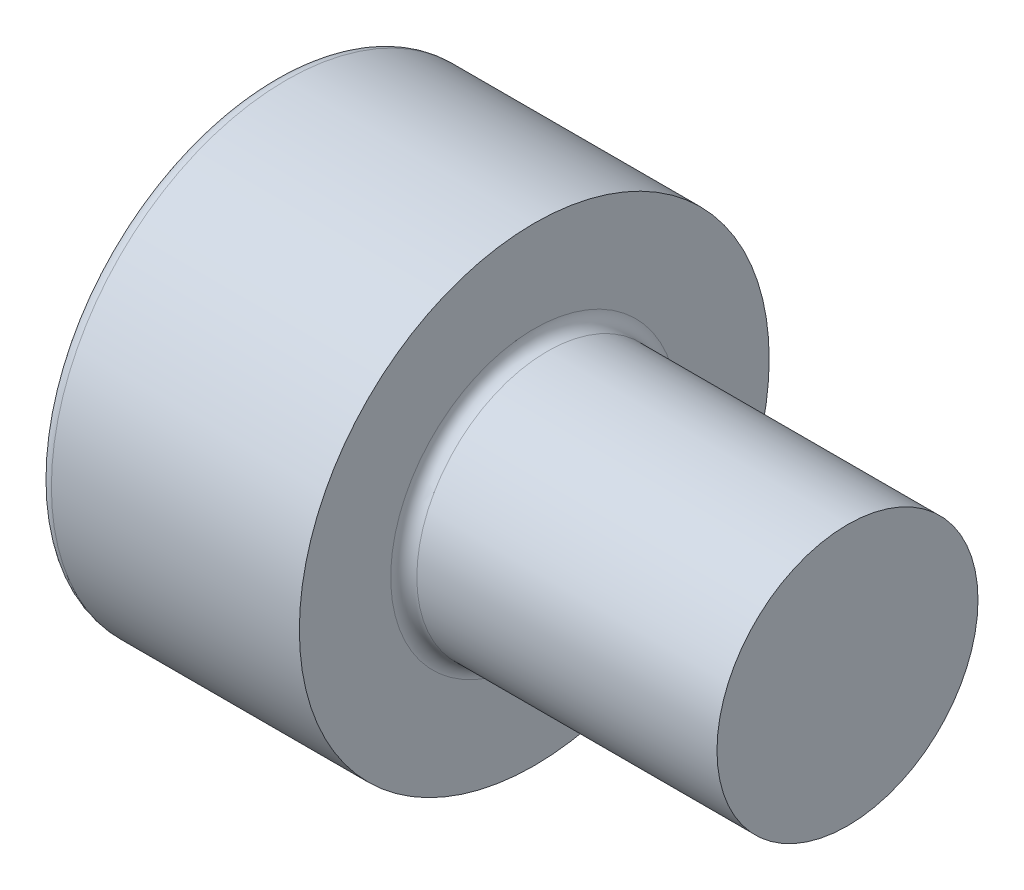
ISO-10303-21;
HEADER;
FILE_DESCRIPTION(('STEP AP214'),'2;1');
FILE_NAME('part.step','',(''),(''),'','','');
FILE_SCHEMA(('AUTOMOTIVE_DESIGN { 1 0 10303 214 1 1 1 1 }'));
ENDSEC;
DATA;
#1=APPLICATION_CONTEXT('core data for automotive mechanical design processes');
#2=APPLICATION_PROTOCOL_DEFINITION('international standard','automotive_design',2000,#1);
#3=PRODUCT_CONTEXT('',#1,'mechanical');
#4=PRODUCT('Part','Part','',(#3));
#5=PRODUCT_RELATED_PRODUCT_CATEGORY('part','',(#4));
#6=PRODUCT_DEFINITION_FORMATION('','',#4);
#7=PRODUCT_DEFINITION_CONTEXT('part definition',#1,'design');
#8=PRODUCT_DEFINITION('design','',#6,#7);
#9=PRODUCT_DEFINITION_SHAPE('','',#8);
#10=(LENGTH_UNIT() NAMED_UNIT(*) SI_UNIT(.MILLI.,.METRE.));
#11=(NAMED_UNIT(*) PLANE_ANGLE_UNIT() SI_UNIT($,.RADIAN.));
#12=(NAMED_UNIT(*) SI_UNIT($,.STERADIAN.) SOLID_ANGLE_UNIT());
#13=UNCERTAINTY_MEASURE_WITH_UNIT(LENGTH_MEASURE(1.E-05),#10,'distance_accuracy_value','');
#14=(GEOMETRIC_REPRESENTATION_CONTEXT(3) GLOBAL_UNCERTAINTY_ASSIGNED_CONTEXT((#13)) GLOBAL_UNIT_ASSIGNED_CONTEXT((#10,
#11,#12)) REPRESENTATION_CONTEXT('',''));
#15=CARTESIAN_POINT('',(0.,0.,0.));
#16=DIRECTION('',(0.,0.,1.));
#17=DIRECTION('',(1.,0.,0.));
#18=AXIS2_PLACEMENT_3D('',#15,#16,#17);
#19=CARTESIAN_POINT('',(10.5,0.,0.));
#20=DIRECTION('',(-1.,0.,0.));
#21=DIRECTION('',(0.,0.,1.));
#22=AXIS2_PLACEMENT_3D('',#19,#20,#21);
#23=CYLINDRICAL_SURFACE('',#22,1.25);
#24=CARTESIAN_POINT('',(2.625,0.,0.));
#25=DIRECTION('',(1.,0.,0.));
#26=DIRECTION('',(0.,0.,-1.));
#27=AXIS2_PLACEMENT_3D('',#24,#25,#26);
#28=CIRCLE('',#27,1.25);
#29=CARTESIAN_POINT('',(2.625,0.,-1.25));
#30=VERTEX_POINT('',#29);
#31=EDGE_CURVE('E171',#30,#30,#28,.T.);
#32=ORIENTED_EDGE('',*,*,#31,.T.);
#33=EDGE_LOOP('',(#32));
#34=FACE_BOUND('',#33,.T.);
#35=CARTESIAN_POINT('',(5.5,0.,0.));
#36=DIRECTION('',(1.,0.,0.));
#37=DIRECTION('',(0.,0.,-1.));
#38=AXIS2_PLACEMENT_3D('',#35,#36,#37);
#39=CIRCLE('',#38,1.25);
#40=CARTESIAN_POINT('',(5.5,0.,-1.25));
#41=VERTEX_POINT('',#40);
#42=EDGE_CURVE('E38',#41,#41,#39,.T.);
#43=ORIENTED_EDGE('',*,*,#42,.F.);
#44=EDGE_LOOP('',(#43));
#45=FACE_BOUND('',#44,.T.);
#46=ADVANCED_FACE('F34',(#34,#45),#23,.T.);
#47=CARTESIAN_POINT('',(1.1,0.,0.));
#48=DIRECTION('',(-1.,0.,0.));
#49=DIRECTION('',(0.,0.,1.));
#50=AXIS2_PLACEMENT_3D('',#47,#48,#49);
#51=PLANE('',#50);
#52=DIRECTION('',(0.,-1.,0.));
#53=VECTOR('',#52,1.);
#54=CARTESIAN_POINT('',(1.1,0.590340650246388,-1.0225));
#55=LINE('',#54,#53);
#56=CARTESIAN_POINT('',(1.1,0.590340650246388,-1.0225));
#57=VERTEX_POINT('',#56);
#58=CARTESIAN_POINT('',(1.10000000000581,0.,-1.0225));
#59=VERTEX_POINT('',#58);
#60=EDGE_CURVE('E224',#57,#59,#55,.T.);
#61=ORIENTED_EDGE('',*,*,#60,.T.);
#62=CARTESIAN_POINT('',(1.10000000000581,0.,0.));
#63=DIRECTION('',(1.,0.,0.));
#64=DIRECTION('',(0.,0.,-1.));
#65=AXIS2_PLACEMENT_3D('',#62,#63,#64);
#66=CIRCLE('',#65,1.02250000003191);
#67=CARTESIAN_POINT('',(1.10000000000581,0.885510975397226,-0.511250000015958));
#68=VERTEX_POINT('',#67);
#69=EDGE_CURVE('E50',#59,#68,#66,.T.);
#70=ORIENTED_EDGE('',*,*,#69,.T.);
#71=DIRECTION('',(0.,-0.500000000000001,-0.866025403784438));
#72=VECTOR('',#71,1.);
#73=CARTESIAN_POINT('',(1.1,1.18068130049278,0.));
#74=LINE('',#73,#72);
#75=EDGE_CURVE('E237',#68,#57,#74,.T.);
#76=ORIENTED_EDGE('',*,*,#75,.T.);
#77=EDGE_LOOP('',(#61,#70,#76));
#78=FACE_BOUND('',#77,.T.);
#79=ADVANCED_FACE('F121',(#78),#51,.T.);
#80=CARTESIAN_POINT('',(1.1,1.18068130049278,0.));
#81=VERTEX_POINT('',#80);
#82=EDGE_CURVE('E238',#81,#68,#74,.T.);
#83=ORIENTED_EDGE('',*,*,#82,.T.);
#84=CARTESIAN_POINT('',(1.10000000000581,0.885510975397227,0.511250000015956));
#85=VERTEX_POINT('',#84);
#86=EDGE_CURVE('E174',#68,#85,#66,.T.);
#87=ORIENTED_EDGE('',*,*,#86,.T.);
#88=DIRECTION('',(0.,0.499999999999999,-0.866025403784439));
#89=VECTOR('',#88,1.);
#90=CARTESIAN_POINT('',(1.1,0.59034065024639,1.0225));
#91=LINE('',#90,#89);
#92=EDGE_CURVE('E234',#85,#81,#91,.T.);
#93=ORIENTED_EDGE('',*,*,#92,.T.);
#94=EDGE_LOOP('',(#83,#87,#93));
#95=FACE_BOUND('',#94,.T.);
#96=ADVANCED_FACE('F130',(#95),#51,.T.);
#97=CARTESIAN_POINT('',(1.1,0.59034065024639,1.0225));
#98=VERTEX_POINT('',#97);
#99=EDGE_CURVE('E235',#98,#85,#91,.T.);
#100=ORIENTED_EDGE('',*,*,#99,.T.);
#101=CARTESIAN_POINT('',(1.10000000000581,0.,1.02250000003191));
#102=VERTEX_POINT('',#101);
#103=EDGE_CURVE('E198',#85,#102,#66,.T.);
#104=ORIENTED_EDGE('',*,*,#103,.T.);
#105=DIRECTION('',(0.,1.,0.));
#106=VECTOR('',#105,1.);
#107=CARTESIAN_POINT('',(1.1,-0.590340650246394,1.0225));
#108=LINE('',#107,#106);
#109=EDGE_CURVE('E231',#102,#98,#108,.T.);
#110=ORIENTED_EDGE('',*,*,#109,.T.);
#111=EDGE_LOOP('',(#100,#104,#110));
#112=FACE_BOUND('',#111,.T.);
#113=ADVANCED_FACE('F270',(#112),#51,.T.);
#114=CARTESIAN_POINT('',(1.1,-0.590340650246394,1.0225));
#115=VERTEX_POINT('',#114);
#116=EDGE_CURVE('E232',#115,#102,#108,.T.);
#117=ORIENTED_EDGE('',*,*,#116,.T.);
#118=CARTESIAN_POINT('',(1.10000000000581,-0.885510975397226,0.511250000015958));
#119=VERTEX_POINT('',#118);
#120=EDGE_CURVE('E203',#102,#119,#66,.T.);
#121=ORIENTED_EDGE('',*,*,#120,.T.);
#122=DIRECTION('',(0.,0.500000000000001,0.866025403784438));
#123=VECTOR('',#122,1.);
#124=CARTESIAN_POINT('',(1.1,-1.18068130049279,0.));
#125=LINE('',#124,#123);
#126=EDGE_CURVE('E228',#119,#115,#125,.T.);
#127=ORIENTED_EDGE('',*,*,#126,.T.);
#128=EDGE_LOOP('',(#117,#121,#127));
#129=FACE_BOUND('',#128,.T.);
#130=ADVANCED_FACE('F152',(#129),#51,.T.);
#131=CARTESIAN_POINT('',(1.1,-1.18068130049279,0.));
#132=VERTEX_POINT('',#131);
#133=EDGE_CURVE('E217',#132,#119,#125,.T.);
#134=ORIENTED_EDGE('',*,*,#133,.T.);
#135=CARTESIAN_POINT('',(1.10000000000581,-0.885510975397228,-0.511250000015955));
#136=VERTEX_POINT('',#135);
#137=EDGE_CURVE('E163',#119,#136,#66,.T.);
#138=ORIENTED_EDGE('',*,*,#137,.T.);
#139=DIRECTION('',(0.,-0.499999999999999,0.86602540378444));
#140=VECTOR('',#139,1.);
#141=CARTESIAN_POINT('',(1.1,-0.590340650246397,-1.0225));
#142=LINE('',#141,#140);
#143=EDGE_CURVE('E214',#136,#132,#142,.T.);
#144=ORIENTED_EDGE('',*,*,#143,.T.);
#145=EDGE_LOOP('',(#134,#138,#144));
#146=FACE_BOUND('',#145,.T.);
#147=ADVANCED_FACE('F122',(#146),#51,.T.);
#148=CARTESIAN_POINT('',(2.5,0.,0.));
#149=DIRECTION('',(-1.,0.,0.));
#150=DIRECTION('',(0.,0.,1.));
#151=AXIS2_PLACEMENT_3D('',#148,#149,#150);
#152=CYLINDRICAL_SURFACE('',#151,2.25);
#153=CARTESIAN_POINT('',(0.125,0.,0.));
#154=DIRECTION('',(-1.,0.,0.));
#155=DIRECTION('',(0.,0.,1.));
#156=AXIS2_PLACEMENT_3D('',#153,#154,#155);
#157=CIRCLE('',#156,2.25);
#158=CARTESIAN_POINT('',(0.125,0.,2.25));
#159=VERTEX_POINT('',#158);
#160=EDGE_CURVE('E11',#159,#159,#157,.F.);
#161=ORIENTED_EDGE('',*,*,#160,.T.);
#162=EDGE_LOOP('',(#161));
#163=FACE_BOUND('',#162,.T.);
#164=CARTESIAN_POINT('',(2.5,0.,0.));
#165=DIRECTION('',(-1.,0.,0.));
#166=DIRECTION('',(0.,0.,1.));
#167=AXIS2_PLACEMENT_3D('',#164,#165,#166);
#168=CIRCLE('',#167,2.25);
#169=CARTESIAN_POINT('',(2.5,0.,2.25));
#170=VERTEX_POINT('',#169);
#171=EDGE_CURVE('E158',#170,#170,#168,.T.);
#172=ORIENTED_EDGE('',*,*,#171,.T.);
#173=EDGE_LOOP('',(#172));
#174=FACE_BOUND('',#173,.T.);
#175=ADVANCED_FACE('F145',(#163,#174),#152,.T.);
#176=CARTESIAN_POINT('',(2.5,2.25,0.));
#177=DIRECTION('',(1.,0.,0.));
#178=DIRECTION('',(0.,0.,-1.));
#179=AXIS2_PLACEMENT_3D('',#176,#177,#178);
#180=PLANE('',#179);
#181=CARTESIAN_POINT('',(2.5,0.,0.));
#182=DIRECTION('',(1.,0.,0.));
#183=DIRECTION('',(0.,0.,-1.));
#184=AXIS2_PLACEMENT_3D('',#181,#182,#183);
#185=CIRCLE('',#184,1.375);
#186=CARTESIAN_POINT('',(2.5,0.,-1.375));
#187=VERTEX_POINT('',#186);
#188=EDGE_CURVE('E173',#187,#187,#185,.F.);
#189=ORIENTED_EDGE('',*,*,#188,.T.);
#190=EDGE_LOOP('',(#189));
#191=FACE_BOUND('',#190,.T.);
#192=ORIENTED_EDGE('',*,*,#171,.F.);
#193=EDGE_LOOP('',(#192));
#194=FACE_BOUND('',#193,.T.);
#195=ADVANCED_FACE('F141',(#191,#194),#180,.T.);
#196=CARTESIAN_POINT('',(0.,0.,0.));
#197=DIRECTION('',(-1.,0.,0.));
#198=DIRECTION('',(0.,0.,1.));
#199=AXIS2_PLACEMENT_3D('',#196,#197,#198);
#200=PLANE('',#199);
#201=CARTESIAN_POINT('',(0.,0.,0.));
#202=DIRECTION('',(-1.,0.,0.));
#203=DIRECTION('',(0.,0.,1.));
#204=AXIS2_PLACEMENT_3D('',#201,#202,#203);
#205=CIRCLE('',#204,2.125);
#206=CARTESIAN_POINT('',(0.,0.,2.125));
#207=VERTEX_POINT('',#206);
#208=EDGE_CURVE('E43',#207,#207,#205,.T.);
#209=ORIENTED_EDGE('',*,*,#208,.T.);
#210=EDGE_LOOP('',(#209));
#211=FACE_BOUND('',#210,.T.);
#212=DIRECTION('',(0.,-1.,0.));
#213=VECTOR('',#212,1.);
#214=CARTESIAN_POINT('',(0.,0.590340650246388,-1.0225));
#215=LINE('',#214,#213);
#216=CARTESIAN_POINT('',(0.,0.590340650246388,-1.0225));
#217=VERTEX_POINT('',#216);
#218=CARTESIAN_POINT('',(0.,-0.590340650246397,-1.0225));
#219=VERTEX_POINT('',#218);
#220=EDGE_CURVE('E58',#217,#219,#215,.T.);
#221=ORIENTED_EDGE('',*,*,#220,.F.);
#222=DIRECTION('',(0.,-0.500000000000001,-0.866025403784438));
#223=VECTOR('',#222,1.);
#224=CARTESIAN_POINT('',(0.,1.18068130049278,0.));
#225=LINE('',#224,#223);
#226=CARTESIAN_POINT('',(0.,1.18068130049278,0.));
#227=VERTEX_POINT('',#226);
#228=EDGE_CURVE('E250',#227,#217,#225,.T.);
#229=ORIENTED_EDGE('',*,*,#228,.F.);
#230=DIRECTION('',(0.,0.499999999999999,-0.866025403784439));
#231=VECTOR('',#230,1.);
#232=CARTESIAN_POINT('',(0.,0.59034065024639,1.0225));
#233=LINE('',#232,#231);
#234=CARTESIAN_POINT('',(0.,0.59034065024639,1.0225));
#235=VERTEX_POINT('',#234);
#236=EDGE_CURVE('E247',#235,#227,#233,.T.);
#237=ORIENTED_EDGE('',*,*,#236,.F.);
#238=DIRECTION('',(0.,1.,0.));
#239=VECTOR('',#238,1.);
#240=CARTESIAN_POINT('',(0.,-0.590340650246394,1.0225));
#241=LINE('',#240,#239);
#242=CARTESIAN_POINT('',(0.,-0.590340650246394,1.0225));
#243=VERTEX_POINT('',#242);
#244=EDGE_CURVE('E244',#243,#235,#241,.T.);
#245=ORIENTED_EDGE('',*,*,#244,.F.);
#246=DIRECTION('',(0.,0.500000000000001,0.866025403784438));
#247=VECTOR('',#246,1.);
#248=CARTESIAN_POINT('',(0.,-1.18068130049279,0.));
#249=LINE('',#248,#247);
#250=CARTESIAN_POINT('',(0.,-1.18068130049279,0.));
#251=VERTEX_POINT('',#250);
#252=EDGE_CURVE('E241',#251,#243,#249,.T.);
#253=ORIENTED_EDGE('',*,*,#252,.F.);
#254=DIRECTION('',(0.,-0.499999999999999,0.86602540378444));
#255=VECTOR('',#254,1.);
#256=CARTESIAN_POINT('',(0.,-0.590340650246397,-1.0225));
#257=LINE('',#256,#255);
#258=EDGE_CURVE('E194',#219,#251,#257,.T.);
#259=ORIENTED_EDGE('',*,*,#258,.F.);
#260=EDGE_LOOP('',(#221,#229,#237,#245,#253,#259));
#261=FACE_BOUND('',#260,.T.);
#262=ADVANCED_FACE('F138',(#211,#261),#200,.T.);
#263=CARTESIAN_POINT('',(1.1,0.590340650246388,-1.0225));
#264=DIRECTION('',(0.,0.,-1.));
#265=DIRECTION('',(0.,1.,0.));
#266=AXIS2_PLACEMENT_3D('',#263,#264,#265);
#267=PLANE('',#266);
#268=ORIENTED_EDGE('',*,*,#220,.T.);
#269=DIRECTION('',(-1.,0.,0.));
#270=VECTOR('',#269,1.);
#271=CARTESIAN_POINT('',(1.1,-0.590340650246397,-1.0225));
#272=LINE('',#271,#270);
#273=CARTESIAN_POINT('',(1.1,-0.590340650246397,-1.0225));
#274=VERTEX_POINT('',#273);
#275=EDGE_CURVE('E169',#274,#219,#272,.T.);
#276=ORIENTED_EDGE('',*,*,#275,.F.);
#277=EDGE_CURVE('E227',#59,#274,#55,.T.);
#278=ORIENTED_EDGE('',*,*,#277,.F.);
#279=ORIENTED_EDGE('',*,*,#60,.F.);
#280=DIRECTION('',(-1.,0.,0.));
#281=VECTOR('',#280,1.);
#282=CARTESIAN_POINT('',(1.1,0.590340650246388,-1.0225));
#283=LINE('',#282,#281);
#284=EDGE_CURVE('E161',#57,#217,#283,.T.);
#285=ORIENTED_EDGE('',*,*,#284,.T.);
#286=EDGE_LOOP('',(#268,#276,#278,#279,#285));
#287=FACE_BOUND('',#286,.T.);
#288=ADVANCED_FACE('F136',(#287),#267,.F.);
#289=CARTESIAN_POINT('',(1.1,1.18068130049278,0.));
#290=DIRECTION('',(0.,0.866025403784438,-0.500000000000001));
#291=DIRECTION('',(0.,0.500000000000001,0.866025403784438));
#292=AXIS2_PLACEMENT_3D('',#289,#290,#291);
#293=PLANE('',#292);
#294=ORIENTED_EDGE('',*,*,#228,.T.);
#295=ORIENTED_EDGE('',*,*,#284,.F.);
#296=ORIENTED_EDGE('',*,*,#75,.F.);
#297=ORIENTED_EDGE('',*,*,#82,.F.);
#298=DIRECTION('',(-1.,0.,0.));
#299=VECTOR('',#298,1.);
#300=CARTESIAN_POINT('',(1.1,1.18068130049278,0.));
#301=LINE('',#300,#299);
#302=EDGE_CURVE('E165',#81,#227,#301,.T.);
#303=ORIENTED_EDGE('',*,*,#302,.T.);
#304=EDGE_LOOP('',(#294,#295,#296,#297,#303));
#305=FACE_BOUND('',#304,.T.);
#306=ADVANCED_FACE('F275',(#305),#293,.F.);
#307=CARTESIAN_POINT('',(1.1,0.59034065024639,1.0225));
#308=DIRECTION('',(0.,0.866025403784439,0.5));
#309=DIRECTION('',(0.,-0.5,0.866025403784439));
#310=AXIS2_PLACEMENT_3D('',#307,#308,#309);
#311=PLANE('',#310);
#312=ORIENTED_EDGE('',*,*,#236,.T.);
#313=ORIENTED_EDGE('',*,*,#302,.F.);
#314=ORIENTED_EDGE('',*,*,#92,.F.);
#315=ORIENTED_EDGE('',*,*,#99,.F.);
#316=DIRECTION('',(-1.,0.,0.));
#317=VECTOR('',#316,1.);
#318=CARTESIAN_POINT('',(1.1,0.59034065024639,1.0225));
#319=LINE('',#318,#317);
#320=EDGE_CURVE('E254',#98,#235,#319,.T.);
#321=ORIENTED_EDGE('',*,*,#320,.T.);
#322=EDGE_LOOP('',(#312,#313,#314,#315,#321));
#323=FACE_BOUND('',#322,.T.);
#324=ADVANCED_FACE('F278',(#323),#311,.F.);
#325=CARTESIAN_POINT('',(1.1,-0.590340650246394,1.0225));
#326=DIRECTION('',(0.,0.,1.));
#327=DIRECTION('',(0.,-1.,0.));
#328=AXIS2_PLACEMENT_3D('',#325,#326,#327);
#329=PLANE('',#328);
#330=ORIENTED_EDGE('',*,*,#244,.T.);
#331=ORIENTED_EDGE('',*,*,#320,.F.);
#332=ORIENTED_EDGE('',*,*,#109,.F.);
#333=ORIENTED_EDGE('',*,*,#116,.F.);
#334=DIRECTION('',(-1.,0.,0.));
#335=VECTOR('',#334,1.);
#336=CARTESIAN_POINT('',(1.1,-0.590340650246394,1.0225));
#337=LINE('',#336,#335);
#338=EDGE_CURVE('E256',#115,#243,#337,.T.);
#339=ORIENTED_EDGE('',*,*,#338,.T.);
#340=EDGE_LOOP('',(#330,#331,#332,#333,#339));
#341=FACE_BOUND('',#340,.T.);
#342=ADVANCED_FACE('F267',(#341),#329,.F.);
#343=CARTESIAN_POINT('',(1.1,-1.18068130049279,0.));
#344=DIRECTION('',(0.,-0.866025403784438,0.500000000000001));
#345=DIRECTION('',(0.,-0.500000000000001,-0.866025403784438));
#346=AXIS2_PLACEMENT_3D('',#343,#344,#345);
#347=PLANE('',#346);
#348=ORIENTED_EDGE('',*,*,#252,.T.);
#349=ORIENTED_EDGE('',*,*,#338,.F.);
#350=ORIENTED_EDGE('',*,*,#126,.F.);
#351=ORIENTED_EDGE('',*,*,#133,.F.);
#352=DIRECTION('',(-1.,0.,0.));
#353=VECTOR('',#352,1.);
#354=CARTESIAN_POINT('',(1.1,-1.18068130049279,0.));
#355=LINE('',#354,#353);
#356=EDGE_CURVE('E223',#132,#251,#355,.T.);
#357=ORIENTED_EDGE('',*,*,#356,.T.);
#358=EDGE_LOOP('',(#348,#349,#350,#351,#357));
#359=FACE_BOUND('',#358,.T.);
#360=ADVANCED_FACE('F264',(#359),#347,.F.);
#361=CARTESIAN_POINT('',(1.1,-0.590340650246397,-1.0225));
#362=DIRECTION('',(0.,-0.86602540378444,-0.499999999999998));
#363=DIRECTION('',(0.,0.499999999999998,-0.86602540378444));
#364=AXIS2_PLACEMENT_3D('',#361,#362,#363);
#365=PLANE('',#364);
#366=ORIENTED_EDGE('',*,*,#258,.T.);
#367=ORIENTED_EDGE('',*,*,#356,.F.);
#368=ORIENTED_EDGE('',*,*,#143,.F.);
#369=EDGE_CURVE('E222',#274,#136,#142,.T.);
#370=ORIENTED_EDGE('',*,*,#369,.F.);
#371=ORIENTED_EDGE('',*,*,#275,.T.);
#372=EDGE_LOOP('',(#366,#367,#368,#370,#371));
#373=FACE_BOUND('',#372,.T.);
#374=ADVANCED_FACE('F118',(#373),#365,.F.);
#375=ORIENTED_EDGE('',*,*,#369,.T.);
#376=EDGE_CURVE('E160',#136,#59,#66,.T.);
#377=ORIENTED_EDGE('',*,*,#376,.T.);
#378=ORIENTED_EDGE('',*,*,#277,.T.);
#379=EDGE_LOOP('',(#375,#377,#378));
#380=FACE_BOUND('',#379,.T.);
#381=ADVANCED_FACE('F111',(#380),#51,.T.);
#382=CARTESIAN_POINT('',(1.69034065027063,0.,0.));
#383=DIRECTION('',(-1.,0.,0.));
#384=DIRECTION('',(0.,0.,1.));
#385=AXIS2_PLACEMENT_3D('',#382,#383,#384);
#386=CONICAL_SURFACE('',#385,0.,1.0471975511966);
#387=ORIENTED_EDGE('',*,*,#69,.F.);
#388=ORIENTED_EDGE('',*,*,#376,.F.);
#389=ORIENTED_EDGE('',*,*,#137,.F.);
#390=ORIENTED_EDGE('',*,*,#120,.F.);
#391=ORIENTED_EDGE('',*,*,#103,.F.);
#392=ORIENTED_EDGE('',*,*,#86,.F.);
#393=EDGE_LOOP('',(#387,#388,#389,#390,#391,#392));
#394=FACE_BOUND('',#393,.T.);
#395=CARTESIAN_POINT('',(1.69034065027063,0.,0.));
#396=VERTEX_POINT('',#395);
#397=VERTEX_LOOP('',#396);
#398=FACE_BOUND('',#397,.T.);
#399=ADVANCED_FACE('F108',(#394,#398),#386,.F.);
#400=CARTESIAN_POINT('',(2.625,0.,0.));
#401=DIRECTION('',(1.,0.,0.));
#402=DIRECTION('',(0.,0.,-1.));
#403=AXIS2_PLACEMENT_3D('',#400,#401,#402);
#404=TOROIDAL_SURFACE('',#403,1.375,0.125);
#405=ORIENTED_EDGE('',*,*,#188,.F.);
#406=EDGE_LOOP('',(#405));
#407=FACE_BOUND('',#406,.T.);
#408=ORIENTED_EDGE('',*,*,#31,.F.);
#409=EDGE_LOOP('',(#408));
#410=FACE_BOUND('',#409,.T.);
#411=ADVANCED_FACE('F110',(#407,#410),#404,.F.);
#412=CARTESIAN_POINT('',(0.125,0.,0.));
#413=DIRECTION('',(-1.,0.,0.));
#414=DIRECTION('',(0.,0.,1.));
#415=AXIS2_PLACEMENT_3D('',#412,#413,#414);
#416=TOROIDAL_SURFACE('',#415,2.125,0.125);
#417=ORIENTED_EDGE('',*,*,#160,.F.);
#418=EDGE_LOOP('',(#417));
#419=FACE_BOUND('',#418,.T.);
#420=ORIENTED_EDGE('',*,*,#208,.F.);
#421=EDGE_LOOP('',(#420));
#422=FACE_BOUND('',#421,.T.);
#423=ADVANCED_FACE('F36',(#419,#422),#416,.T.);
#424=CARTESIAN_POINT('',(5.5,-2.7089585150932,10.));
#425=DIRECTION('',(1.,0.,0.));
#426=DIRECTION('',(0.,0.,-1.));
#427=AXIS2_PLACEMENT_3D('',#424,#425,#426);
#428=PLANE('',#427);
#429=ORIENTED_EDGE('',*,*,#42,.T.);
#430=EDGE_LOOP('',(#429));
#431=FACE_BOUND('',#430,.T.);
#432=ADVANCED_FACE('F182',(#431),#428,.T.);
#433=CLOSED_SHELL('',(#46,#79,#96,#113,#130,#147,#175,#195,#262,#288,#306,#324,#342,#360,#374,
#381,#399,#411,#423,#432));
#434=MANIFOLD_SOLID_BREP('B2',#433);
#435=ADVANCED_BREP_SHAPE_REPRESENTATION('',(#18,#434),#14);
#436=SHAPE_DEFINITION_REPRESENTATION(#9,#435);
ENDSEC;
END-ISO-10303-21;
